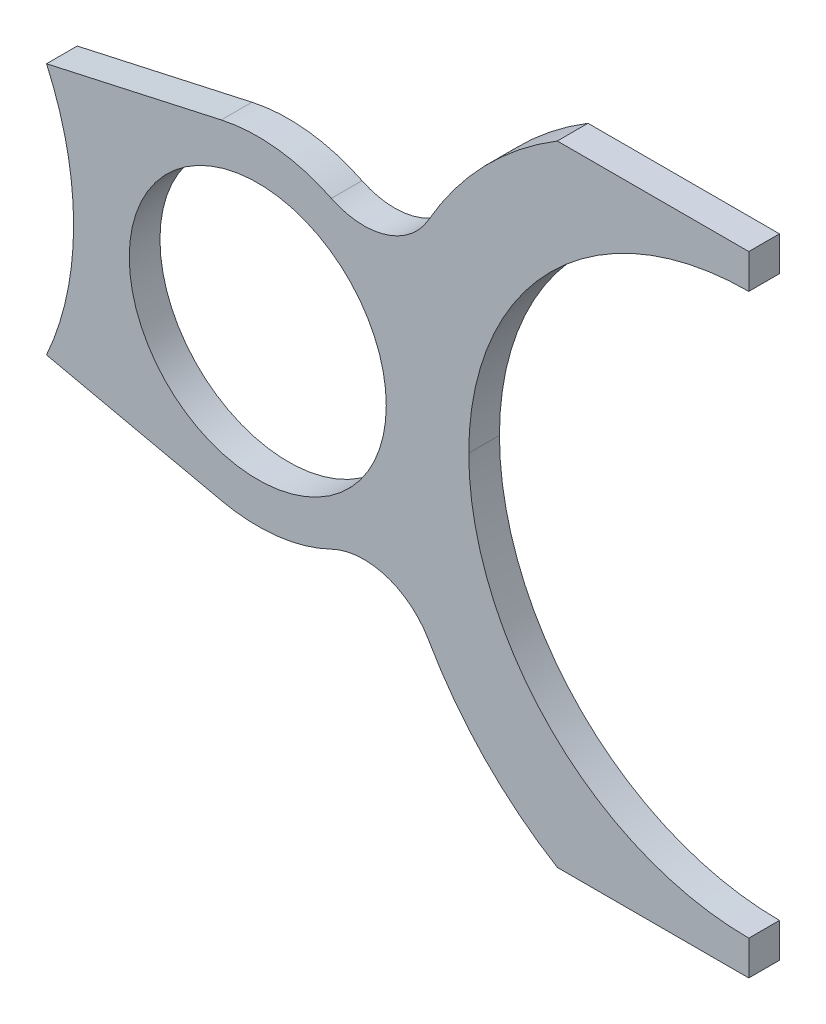
ISO-10303-21;
HEADER;
FILE_DESCRIPTION(('STEP AP214'),'2;1');
FILE_NAME('part.step','',(''),(''),'','','');
FILE_SCHEMA(('AUTOMOTIVE_DESIGN { 1 0 10303 214 1 1 1 1 }'));
ENDSEC;
DATA;
#1=APPLICATION_CONTEXT('core data for automotive mechanical design processes');
#2=APPLICATION_PROTOCOL_DEFINITION('international standard','automotive_design',2000,#1);
#3=PRODUCT_CONTEXT('',#1,'mechanical');
#4=PRODUCT('Part','Part','',(#3));
#5=PRODUCT_RELATED_PRODUCT_CATEGORY('part','',(#4));
#6=PRODUCT_DEFINITION_FORMATION('','',#4);
#7=PRODUCT_DEFINITION_CONTEXT('part definition',#1,'design');
#8=PRODUCT_DEFINITION('design','',#6,#7);
#9=PRODUCT_DEFINITION_SHAPE('','',#8);
#10=(LENGTH_UNIT() NAMED_UNIT(*) SI_UNIT(.MILLI.,.METRE.));
#11=(NAMED_UNIT(*) PLANE_ANGLE_UNIT() SI_UNIT($,.RADIAN.));
#12=(NAMED_UNIT(*) SI_UNIT($,.STERADIAN.) SOLID_ANGLE_UNIT());
#13=UNCERTAINTY_MEASURE_WITH_UNIT(LENGTH_MEASURE(1.E-05),#10,'distance_accuracy_value','');
#14=(GEOMETRIC_REPRESENTATION_CONTEXT(3) GLOBAL_UNCERTAINTY_ASSIGNED_CONTEXT((#13)) GLOBAL_UNIT_ASSIGNED_CONTEXT((#10,
#11,#12)) REPRESENTATION_CONTEXT('',''));
#15=CARTESIAN_POINT('',(0.,0.,0.));
#16=DIRECTION('',(0.,0.,1.));
#17=DIRECTION('',(1.,0.,0.));
#18=AXIS2_PLACEMENT_3D('',#15,#16,#17);
#19=CARTESIAN_POINT('',(74.4480072134487,-16.0000723388043,2.));
#20=DIRECTION('',(0.,0.,1.));
#21=DIRECTION('',(1.,0.,0.));
#22=AXIS2_PLACEMENT_3D('',#19,#20,#21);
#23=PLANE('',#22);
#24=CARTESIAN_POINT('',(74.4480072134487,-16.0000723388043,2.));
#25=DIRECTION('',(0.,0.,-1.));
#26=DIRECTION('',(1.,0.,0.));
#27=AXIS2_PLACEMENT_3D('',#24,#25,#26);
#28=CIRCLE('',#27,18.2499999997204);
#29=CARTESIAN_POINT('',(56.1980072137284,-16.0000706020517,2.));
#30=VERTEX_POINT('',#29);
#31=CARTESIAN_POINT('',(74.4480109338911,2.24992766091565,2.));
#32=VERTEX_POINT('',#31);
#33=EDGE_CURVE('E209',#30,#32,#28,.T.);
#34=ORIENTED_EDGE('',*,*,#33,.T.);
#35=DIRECTION('',(-2.68384574157079E-06,0.999999999996398,0.));
#36=VECTOR('',#35,1.);
#37=CARTESIAN_POINT('',(74.4480109338911,2.24992766091565,2.));
#38=LINE('',#37,#36);
#39=CARTESIAN_POINT('',(74.4480048948167,4.50008471778701,2.));
#40=VERTEX_POINT('',#39);
#41=EDGE_CURVE('E117',#32,#40,#38,.T.);
#42=ORIENTED_EDGE('',*,*,#41,.T.);
#43=DIRECTION('',(-0.999999999979796,-6.356641535331E-06,0.));
#44=VECTOR('',#43,1.);
#45=CARTESIAN_POINT('',(74.4480048948167,4.50008471778701,2.));
#46=LINE('',#45,#44);
#47=CARTESIAN_POINT('',(61.9681509162957,4.50000538782885,2.));
#48=VERTEX_POINT('',#47);
#49=EDGE_CURVE('E248',#40,#48,#46,.T.);
#50=ORIENTED_EDGE('',*,*,#49,.T.);
#51=CARTESIAN_POINT('',(74.4480072134487,-16.0000723388043,2.));
#52=DIRECTION('',(0.,0.,1.));
#53=DIRECTION('',(1.,0.,0.));
#54=AXIS2_PLACEMENT_3D('',#51,#52,#53);
#55=CIRCLE('',#54,24.0000000000073);
#56=CARTESIAN_POINT('',(53.5884918374886,-4.13075819347851,2.));
#57=VERTEX_POINT('',#56);
#58=EDGE_CURVE('E267',#48,#57,#55,.T.);
#59=ORIENTED_EDGE('',*,*,#58,.T.);
#60=CARTESIAN_POINT('',(49.3641728632781,-1.72707008982647,2.));
#61=DIRECTION('',(0.,0.,-1.));
#62=DIRECTION('',(1.,0.,0.));
#63=AXIS2_PLACEMENT_3D('',#60,#61,#62);
#64=CIRCLE('',#63,4.86030732511318);
#65=CARTESIAN_POINT('',(47.2447504661089,-6.10092834049331,2.));
#66=VERTEX_POINT('',#65);
#67=EDGE_CURVE('E264',#57,#66,#64,.T.);
#68=ORIENTED_EDGE('',*,*,#67,.T.);
#69=CARTESIAN_POINT('',(42.4480072131691,-15.9999815358943,2.));
#70=DIRECTION('',(0.,0.,1.));
#71=DIRECTION('',(1.,0.,0.));
#72=AXIS2_PLACEMENT_3D('',#69,#70,#71);
#73=CIRCLE('',#72,11.0000000000002);
#74=CARTESIAN_POINT('',(40.0693650208145,-5.26023939184106,2.));
#75=VERTEX_POINT('',#74);
#76=EDGE_CURVE('E266',#66,#75,#73,.T.);
#77=ORIENTED_EDGE('',*,*,#76,.T.);
#78=DIRECTION('',(-0.976340194913392,-0.216240199307343,0.));
#79=VECTOR('',#78,1.);
#80=CARTESIAN_POINT('',(40.0693650208145,-5.26023939184106,2.));
#81=LINE('',#80,#79);
#82=CARTESIAN_POINT('',(28.6821077627801,-7.78229347900254,2.));
#83=VERTEX_POINT('',#82);
#84=EDGE_CURVE('E269',#75,#83,#81,.T.);
#85=ORIENTED_EDGE('',*,*,#84,.T.);
#86=CARTESIAN_POINT('',(10.4482772196499,-15.9998006268187,2.));
#87=DIRECTION('',(0.,0.,-1.));
#88=DIRECTION('',(1.,0.,0.));
#89=AXIS2_PLACEMENT_3D('',#86,#87,#88);
#90=CIRCLE('',#89,20.);
#91=CARTESIAN_POINT('',(30.4482772186561,-16.0000000007485,2.));
#92=VERTEX_POINT('',#91);
#93=EDGE_CURVE('E275',#83,#92,#90,.T.);
#94=ORIENTED_EDGE('',*,*,#93,.T.);
#95=CARTESIAN_POINT('',(10.44827721965,-16.0001993746783,2.));
#96=DIRECTION('',(0.,0.,-1.));
#97=DIRECTION('',(1.,0.,0.));
#98=AXIS2_PLACEMENT_3D('',#95,#96,#97);
#99=CIRCLE('',#98,19.9999999999999);
#100=CARTESIAN_POINT('',(28.6821077627801,-24.2177065224945,2.));
#101=VERTEX_POINT('',#100);
#102=EDGE_CURVE('E277',#92,#101,#99,.T.);
#103=ORIENTED_EDGE('',*,*,#102,.T.);
#104=DIRECTION('',(0.97634019491392,-0.216240199304961,0.));
#105=VECTOR('',#104,1.);
#106=CARTESIAN_POINT('',(28.6821077627801,-24.2177065224945,2.));
#107=LINE('',#106,#105);
#108=CARTESIAN_POINT('',(40.0693650208207,-26.7397606096282,2.));
#109=VERTEX_POINT('',#108);
#110=EDGE_CURVE('E279',#101,#109,#107,.T.);
#111=ORIENTED_EDGE('',*,*,#110,.T.);
#112=CARTESIAN_POINT('',(42.4480072131691,-16.0000184656028,2.));
#113=DIRECTION('',(0.,0.,1.));
#114=DIRECTION('',(1.,0.,0.));
#115=AXIS2_PLACEMENT_3D('',#112,#113,#114);
#116=CIRCLE('',#115,10.9999999999716);
#117=CARTESIAN_POINT('',(47.2447504660965,-25.8990716609781,2.));
#118=VERTEX_POINT('',#117);
#119=EDGE_CURVE('E281',#109,#118,#116,.T.);
#120=ORIENTED_EDGE('',*,*,#119,.T.);
#121=CARTESIAN_POINT('',(49.3641728632567,-30.2729299116639,2.));
#122=DIRECTION('',(0.,0.,-1.));
#123=DIRECTION('',(1.,0.,0.));
#124=AXIS2_PLACEMENT_3D('',#121,#122,#123);
#125=CIRCLE('',#124,4.86030732512629);
#126=CARTESIAN_POINT('',(53.5884918374005,-27.8692418080686,2.));
#127=VERTEX_POINT('',#126);
#128=EDGE_CURVE('E283',#118,#127,#125,.T.);
#129=ORIENTED_EDGE('',*,*,#128,.T.);
#130=CARTESIAN_POINT('',(74.4480072131689,-15.9999276624131,2.));
#131=DIRECTION('',(0.,0.,1.));
#132=DIRECTION('',(1.,0.,0.));
#133=AXIS2_PLACEMENT_3D('',#130,#131,#132);
#134=CIRCLE('',#133,24.0000000000037);
#135=CARTESIAN_POINT('',(61.9681509162946,-36.5000053893278,2.));
#136=VERTEX_POINT('',#135);
#137=EDGE_CURVE('E160',#127,#136,#134,.T.);
#138=ORIENTED_EDGE('',*,*,#137,.T.);
#139=DIRECTION('',(0.999999999979797,-6.35664138479136E-06,0.));
#140=VECTOR('',#139,1.);
#141=CARTESIAN_POINT('',(61.9681509162946,-36.5000053893278,2.));
#142=LINE('',#141,#140);
#143=CARTESIAN_POINT('',(74.4480048948167,-36.5000847192841,2.));
#144=VERTEX_POINT('',#143);
#145=EDGE_CURVE('E154',#136,#144,#142,.T.);
#146=ORIENTED_EDGE('',*,*,#145,.T.);
#147=DIRECTION('',(2.68384574157115E-06,0.999999999996398,0.));
#148=VECTOR('',#147,1.);
#149=CARTESIAN_POINT('',(74.4480048948167,-36.5000847192841,2.));
#150=LINE('',#149,#148);
#151=CARTESIAN_POINT('',(74.4480109338911,-34.249927662413,2.));
#152=VERTEX_POINT('',#151);
#153=EDGE_CURVE('E158',#144,#152,#150,.T.);
#154=ORIENTED_EDGE('',*,*,#153,.T.);
#155=CARTESIAN_POINT('',(74.4480072131689,-15.9999276624131,2.));
#156=DIRECTION('',(0.,0.,-1.));
#157=DIRECTION('',(1.,0.,0.));
#158=AXIS2_PLACEMENT_3D('',#155,#156,#157);
#159=CIRCLE('',#158,18.2500000000003);
#160=EDGE_CURVE('E50',#152,#30,#159,.T.);
#161=ORIENTED_EDGE('',*,*,#160,.T.);
#162=EDGE_LOOP('',(#34,#42,#50,#59,#68,#77,#85,#94,#103,#111,#120,#129,#138,#146,#154,#161));
#163=FACE_BOUND('',#162,.T.);
#164=CARTESIAN_POINT('',(42.4480072131691,-15.9999815358943,2.));
#165=DIRECTION('',(0.,0.,1.));
#166=DIRECTION('',(1.,0.,0.));
#167=AXIS2_PLACEMENT_3D('',#164,#165,#166);
#168=CIRCLE('',#167,8.37500000000001);
#169=CARTESIAN_POINT('',(50.8230072131691,-15.9999815358943,2.));
#170=VERTEX_POINT('',#169);
#171=EDGE_CURVE('E182',#170,#170,#168,.T.);
#172=ORIENTED_EDGE('',*,*,#171,.F.);
#173=EDGE_LOOP('',(#172));
#174=FACE_BOUND('',#173,.T.);
#175=ADVANCED_FACE('F33',(#163,#174),#23,.T.);
#176=CARTESIAN_POINT('',(74.4480072134487,-16.0000723388043,0.));
#177=DIRECTION('',(0.,0.,1.));
#178=DIRECTION('',(1.,0.,0.));
#179=AXIS2_PLACEMENT_3D('',#176,#177,#178);
#180=PLANE('',#179);
#181=CARTESIAN_POINT('',(74.4480072134487,-16.0000723388043,0.));
#182=DIRECTION('',(0.,0.,-1.));
#183=DIRECTION('',(1.,0.,0.));
#184=AXIS2_PLACEMENT_3D('',#181,#182,#183);
#185=CIRCLE('',#184,18.2499999997204);
#186=CARTESIAN_POINT('',(56.1980072137284,-16.0000706020517,0.));
#187=VERTEX_POINT('',#186);
#188=CARTESIAN_POINT('',(74.4480109338911,2.24992766091565,0.));
#189=VERTEX_POINT('',#188);
#190=EDGE_CURVE('E178',#187,#189,#185,.T.);
#191=ORIENTED_EDGE('',*,*,#190,.F.);
#192=CARTESIAN_POINT('',(74.4480072131689,-15.9999276624131,0.));
#193=DIRECTION('',(0.,0.,-1.));
#194=DIRECTION('',(1.,0.,0.));
#195=AXIS2_PLACEMENT_3D('',#192,#193,#194);
#196=CIRCLE('',#195,18.2500000000003);
#197=CARTESIAN_POINT('',(74.4480109338911,-34.249927662413,0.));
#198=VERTEX_POINT('',#197);
#199=EDGE_CURVE('E109',#198,#187,#196,.T.);
#200=ORIENTED_EDGE('',*,*,#199,.F.);
#201=DIRECTION('',(2.68384574157115E-06,0.999999999996398,0.));
#202=VECTOR('',#201,1.);
#203=CARTESIAN_POINT('',(74.4480048948167,-36.5000847192841,0.));
#204=LINE('',#203,#202);
#205=CARTESIAN_POINT('',(74.4480048948167,-36.5000847192841,0.));
#206=VERTEX_POINT('',#205);
#207=EDGE_CURVE('E103',#206,#198,#204,.T.);
#208=ORIENTED_EDGE('',*,*,#207,.F.);
#209=DIRECTION('',(0.999999999979797,-6.35664138479136E-06,0.));
#210=VECTOR('',#209,1.);
#211=CARTESIAN_POINT('',(61.9681509162946,-36.5000053893278,0.));
#212=LINE('',#211,#210);
#213=CARTESIAN_POINT('',(61.9681509162946,-36.5000053893278,0.));
#214=VERTEX_POINT('',#213);
#215=EDGE_CURVE('E168',#214,#206,#212,.T.);
#216=ORIENTED_EDGE('',*,*,#215,.F.);
#217=CARTESIAN_POINT('',(74.4480072131689,-15.9999276624131,0.));
#218=DIRECTION('',(0.,0.,1.));
#219=DIRECTION('',(1.,0.,0.));
#220=AXIS2_PLACEMENT_3D('',#217,#218,#219);
#221=CIRCLE('',#220,24.0000000000037);
#222=CARTESIAN_POINT('',(53.5884918374005,-27.8692418080686,0.));
#223=VERTEX_POINT('',#222);
#224=EDGE_CURVE('E204',#223,#214,#221,.T.);
#225=ORIENTED_EDGE('',*,*,#224,.F.);
#226=CARTESIAN_POINT('',(49.3641728632567,-30.2729299116639,0.));
#227=DIRECTION('',(0.,0.,-1.));
#228=DIRECTION('',(1.,0.,0.));
#229=AXIS2_PLACEMENT_3D('',#226,#227,#228);
#230=CIRCLE('',#229,4.86030732512629);
#231=CARTESIAN_POINT('',(47.2447504660965,-25.8990716609781,0.));
#232=VERTEX_POINT('',#231);
#233=EDGE_CURVE('E202',#232,#223,#230,.T.);
#234=ORIENTED_EDGE('',*,*,#233,.F.);
#235=CARTESIAN_POINT('',(42.4480072131691,-16.0000184656028,0.));
#236=DIRECTION('',(0.,0.,1.));
#237=DIRECTION('',(1.,0.,0.));
#238=AXIS2_PLACEMENT_3D('',#235,#236,#237);
#239=CIRCLE('',#238,10.9999999999716);
#240=CARTESIAN_POINT('',(40.0693650208207,-26.7397606096282,0.));
#241=VERTEX_POINT('',#240);
#242=EDGE_CURVE('E200',#241,#232,#239,.T.);
#243=ORIENTED_EDGE('',*,*,#242,.F.);
#244=DIRECTION('',(0.97634019491392,-0.216240199304961,0.));
#245=VECTOR('',#244,1.);
#246=CARTESIAN_POINT('',(28.6821077627801,-24.2177065224945,0.));
#247=LINE('',#246,#245);
#248=CARTESIAN_POINT('',(28.6821077627801,-24.2177065224945,0.));
#249=VERTEX_POINT('',#248);
#250=EDGE_CURVE('E198',#249,#241,#247,.T.);
#251=ORIENTED_EDGE('',*,*,#250,.F.);
#252=CARTESIAN_POINT('',(10.44827721965,-16.0001993746783,0.));
#253=DIRECTION('',(0.,0.,-1.));
#254=DIRECTION('',(1.,0.,0.));
#255=AXIS2_PLACEMENT_3D('',#252,#253,#254);
#256=CIRCLE('',#255,19.9999999999999);
#257=CARTESIAN_POINT('',(30.4482772186561,-16.0000000007485,0.));
#258=VERTEX_POINT('',#257);
#259=EDGE_CURVE('E196',#258,#249,#256,.T.);
#260=ORIENTED_EDGE('',*,*,#259,.F.);
#261=CARTESIAN_POINT('',(10.4482772196499,-15.9998006268187,0.));
#262=DIRECTION('',(0.,0.,-1.));
#263=DIRECTION('',(1.,0.,0.));
#264=AXIS2_PLACEMENT_3D('',#261,#262,#263);
#265=CIRCLE('',#264,20.);
#266=CARTESIAN_POINT('',(28.6821077627801,-7.78229347900254,0.));
#267=VERTEX_POINT('',#266);
#268=EDGE_CURVE('E194',#267,#258,#265,.T.);
#269=ORIENTED_EDGE('',*,*,#268,.F.);
#270=DIRECTION('',(-0.976340194913392,-0.216240199307343,0.));
#271=VECTOR('',#270,1.);
#272=CARTESIAN_POINT('',(40.0693650208145,-5.26023939184106,0.));
#273=LINE('',#272,#271);
#274=CARTESIAN_POINT('',(40.0693650208145,-5.26023939184106,0.));
#275=VERTEX_POINT('',#274);
#276=EDGE_CURVE('E192',#275,#267,#273,.T.);
#277=ORIENTED_EDGE('',*,*,#276,.F.);
#278=CARTESIAN_POINT('',(42.4480072131691,-15.9999815358943,0.));
#279=DIRECTION('',(0.,0.,1.));
#280=DIRECTION('',(1.,0.,0.));
#281=AXIS2_PLACEMENT_3D('',#278,#279,#280);
#282=CIRCLE('',#281,11.0000000000002);
#283=CARTESIAN_POINT('',(47.2447504661089,-6.10092834049331,0.));
#284=VERTEX_POINT('',#283);
#285=EDGE_CURVE('E190',#284,#275,#282,.T.);
#286=ORIENTED_EDGE('',*,*,#285,.F.);
#287=CARTESIAN_POINT('',(49.3641728632781,-1.72707008982647,0.));
#288=DIRECTION('',(0.,0.,-1.));
#289=DIRECTION('',(1.,0.,0.));
#290=AXIS2_PLACEMENT_3D('',#287,#288,#289);
#291=CIRCLE('',#290,4.86030732511318);
#292=CARTESIAN_POINT('',(53.5884918374886,-4.13075819347851,0.));
#293=VERTEX_POINT('',#292);
#294=EDGE_CURVE('E188',#293,#284,#291,.T.);
#295=ORIENTED_EDGE('',*,*,#294,.F.);
#296=CARTESIAN_POINT('',(74.4480072134487,-16.0000723388043,0.));
#297=DIRECTION('',(0.,0.,1.));
#298=DIRECTION('',(1.,0.,0.));
#299=AXIS2_PLACEMENT_3D('',#296,#297,#298);
#300=CIRCLE('',#299,24.0000000000073);
#301=CARTESIAN_POINT('',(61.9681509162957,4.50000538782885,0.));
#302=VERTEX_POINT('',#301);
#303=EDGE_CURVE('E186',#302,#293,#300,.T.);
#304=ORIENTED_EDGE('',*,*,#303,.F.);
#305=DIRECTION('',(-0.999999999979796,-6.356641535331E-06,0.));
#306=VECTOR('',#305,1.);
#307=CARTESIAN_POINT('',(74.4480048948167,4.50008471778701,0.));
#308=LINE('',#307,#306);
#309=CARTESIAN_POINT('',(74.4480048948167,4.50008471778701,0.));
#310=VERTEX_POINT('',#309);
#311=EDGE_CURVE('E184',#310,#302,#308,.T.);
#312=ORIENTED_EDGE('',*,*,#311,.F.);
#313=DIRECTION('',(-2.68384574157079E-06,0.999999999996398,0.));
#314=VECTOR('',#313,1.);
#315=CARTESIAN_POINT('',(74.4480109338911,2.24992766091565,0.));
#316=LINE('',#315,#314);
#317=EDGE_CURVE('E181',#189,#310,#316,.T.);
#318=ORIENTED_EDGE('',*,*,#317,.F.);
#319=EDGE_LOOP('',(#191,#200,#208,#216,#225,#234,#243,#251,#260,#269,#277,#286,#295,#304,#312,#318));
#320=FACE_BOUND('',#319,.T.);
#321=CARTESIAN_POINT('',(42.4480072131691,-15.9999815358943,0.));
#322=DIRECTION('',(0.,0.,1.));
#323=DIRECTION('',(1.,0.,0.));
#324=AXIS2_PLACEMENT_3D('',#321,#322,#323);
#325=CIRCLE('',#324,8.37500000000001);
#326=CARTESIAN_POINT('',(50.8230072131691,-15.9999815358943,0.));
#327=VERTEX_POINT('',#326);
#328=EDGE_CURVE('E482',#327,#327,#325,.T.);
#329=ORIENTED_EDGE('',*,*,#328,.T.);
#330=EDGE_LOOP('',(#329));
#331=FACE_BOUND('',#330,.T.);
#332=ADVANCED_FACE('F252',(#320,#331),#180,.F.);
#333=CARTESIAN_POINT('',(74.4480072134487,-16.0000723388043,2.));
#334=DIRECTION('',(0.,0.,-1.));
#335=DIRECTION('',(-1.,0.,0.));
#336=AXIS2_PLACEMENT_3D('',#333,#334,#335);
#337=CYLINDRICAL_SURFACE('',#336,18.2499999997204);
#338=ORIENTED_EDGE('',*,*,#190,.T.);
#339=DIRECTION('',(0.,0.,-1.));
#340=VECTOR('',#339,1.);
#341=CARTESIAN_POINT('',(74.4480109338911,2.24992766091565,2.));
#342=LINE('',#341,#340);
#343=EDGE_CURVE('E11',#32,#189,#342,.T.);
#344=ORIENTED_EDGE('',*,*,#343,.F.);
#345=ORIENTED_EDGE('',*,*,#33,.F.);
#346=DIRECTION('',(0.,0.,-1.));
#347=VECTOR('',#346,1.);
#348=CARTESIAN_POINT('',(56.1980072137284,-16.0000706020517,2.));
#349=LINE('',#348,#347);
#350=EDGE_CURVE('E174',#30,#187,#349,.T.);
#351=ORIENTED_EDGE('',*,*,#350,.T.);
#352=EDGE_LOOP('',(#338,#344,#345,#351));
#353=FACE_BOUND('',#352,.T.);
#354=ADVANCED_FACE('F35',(#353),#337,.F.);
#355=CARTESIAN_POINT('',(74.4480109338911,2.24992766091565,2.));
#356=DIRECTION('',(-0.999999999996399,-2.68384574157079E-06,0.));
#357=DIRECTION('',(2.68384574157079E-06,-0.999999999996399,0.));
#358=AXIS2_PLACEMENT_3D('',#355,#356,#357);
#359=PLANE('',#358);
#360=ORIENTED_EDGE('',*,*,#317,.T.);
#361=DIRECTION('',(0.,0.,-1.));
#362=VECTOR('',#361,1.);
#363=CARTESIAN_POINT('',(74.4480048948167,4.50008471778701,2.));
#364=LINE('',#363,#362);
#365=EDGE_CURVE('E42',#40,#310,#364,.T.);
#366=ORIENTED_EDGE('',*,*,#365,.F.);
#367=ORIENTED_EDGE('',*,*,#41,.F.);
#368=ORIENTED_EDGE('',*,*,#343,.T.);
#369=EDGE_LOOP('',(#360,#366,#367,#368));
#370=FACE_BOUND('',#369,.T.);
#371=ADVANCED_FACE('F317',(#370),#359,.F.);
#372=CARTESIAN_POINT('',(74.4480048948167,4.50008471778701,2.));
#373=DIRECTION('',(6.356641535331E-06,-0.999999999979797,0.));
#374=DIRECTION('',(0.999999999979797,6.356641535331E-06,0.));
#375=AXIS2_PLACEMENT_3D('',#372,#373,#374);
#376=PLANE('',#375);
#377=ORIENTED_EDGE('',*,*,#311,.T.);
#378=DIRECTION('',(0.,0.,-1.));
#379=VECTOR('',#378,1.);
#380=CARTESIAN_POINT('',(61.9681509162957,4.50000538782885,2.));
#381=LINE('',#380,#379);
#382=EDGE_CURVE('E240',#48,#302,#381,.T.);
#383=ORIENTED_EDGE('',*,*,#382,.F.);
#384=ORIENTED_EDGE('',*,*,#49,.F.);
#385=ORIENTED_EDGE('',*,*,#365,.T.);
#386=EDGE_LOOP('',(#377,#383,#384,#385));
#387=FACE_BOUND('',#386,.T.);
#388=ADVANCED_FACE('F246',(#387),#376,.F.);
#389=CARTESIAN_POINT('',(74.4480072134487,-16.0000723388043,2.));
#390=DIRECTION('',(0.,0.,-1.));
#391=DIRECTION('',(-1.,0.,0.));
#392=AXIS2_PLACEMENT_3D('',#389,#390,#391);
#393=CYLINDRICAL_SURFACE('',#392,24.0000000000073);
#394=ORIENTED_EDGE('',*,*,#303,.T.);
#395=DIRECTION('',(0.,0.,-1.));
#396=VECTOR('',#395,1.);
#397=CARTESIAN_POINT('',(53.5884918374886,-4.13075819347851,2.));
#398=LINE('',#397,#396);
#399=EDGE_CURVE('E237',#57,#293,#398,.T.);
#400=ORIENTED_EDGE('',*,*,#399,.F.);
#401=ORIENTED_EDGE('',*,*,#58,.F.);
#402=ORIENTED_EDGE('',*,*,#382,.T.);
#403=EDGE_LOOP('',(#394,#400,#401,#402));
#404=FACE_BOUND('',#403,.T.);
#405=ADVANCED_FACE('F258',(#404),#393,.T.);
#406=CARTESIAN_POINT('',(49.3641728632781,-1.72707008982647,2.));
#407=DIRECTION('',(0.,0.,-1.));
#408=DIRECTION('',(-1.,0.,0.));
#409=AXIS2_PLACEMENT_3D('',#406,#407,#408);
#410=CYLINDRICAL_SURFACE('',#409,4.86030732511318);
#411=ORIENTED_EDGE('',*,*,#294,.T.);
#412=DIRECTION('',(0.,0.,-1.));
#413=VECTOR('',#412,1.);
#414=CARTESIAN_POINT('',(47.2447504661089,-6.10092834049331,2.));
#415=LINE('',#414,#413);
#416=EDGE_CURVE('E234',#66,#284,#415,.T.);
#417=ORIENTED_EDGE('',*,*,#416,.F.);
#418=ORIENTED_EDGE('',*,*,#67,.F.);
#419=ORIENTED_EDGE('',*,*,#399,.T.);
#420=EDGE_LOOP('',(#411,#417,#418,#419));
#421=FACE_BOUND('',#420,.T.);
#422=ADVANCED_FACE('F262',(#421),#410,.F.);
#423=CARTESIAN_POINT('',(42.4480072131691,-15.9999815358943,2.));
#424=DIRECTION('',(0.,0.,-1.));
#425=DIRECTION('',(-1.,0.,0.));
#426=AXIS2_PLACEMENT_3D('',#423,#424,#425);
#427=CYLINDRICAL_SURFACE('',#426,11.0000000000002);
#428=ORIENTED_EDGE('',*,*,#285,.T.);
#429=DIRECTION('',(0.,0.,-1.));
#430=VECTOR('',#429,1.);
#431=CARTESIAN_POINT('',(40.0693650208145,-5.26023939184106,2.));
#432=LINE('',#431,#430);
#433=EDGE_CURVE('E231',#75,#275,#432,.T.);
#434=ORIENTED_EDGE('',*,*,#433,.F.);
#435=ORIENTED_EDGE('',*,*,#76,.F.);
#436=ORIENTED_EDGE('',*,*,#416,.T.);
#437=EDGE_LOOP('',(#428,#434,#435,#436));
#438=FACE_BOUND('',#437,.T.);
#439=ADVANCED_FACE('F330',(#438),#427,.T.);
#440=CARTESIAN_POINT('',(40.0693650208145,-5.26023939184106,2.));
#441=DIRECTION('',(0.216240199307343,-0.976340194913392,0.));
#442=DIRECTION('',(0.976340194913392,0.216240199307344,0.));
#443=AXIS2_PLACEMENT_3D('',#440,#441,#442);
#444=PLANE('',#443);
#445=ORIENTED_EDGE('',*,*,#276,.T.);
#446=DIRECTION('',(0.,0.,-1.));
#447=VECTOR('',#446,1.);
#448=CARTESIAN_POINT('',(28.6821077627801,-7.78229347900254,2.));
#449=LINE('',#448,#447);
#450=EDGE_CURVE('E228',#83,#267,#449,.T.);
#451=ORIENTED_EDGE('',*,*,#450,.F.);
#452=ORIENTED_EDGE('',*,*,#84,.F.);
#453=ORIENTED_EDGE('',*,*,#433,.T.);
#454=EDGE_LOOP('',(#445,#451,#452,#453));
#455=FACE_BOUND('',#454,.T.);
#456=ADVANCED_FACE('F333',(#455),#444,.F.);
#457=CARTESIAN_POINT('',(10.4482772196499,-15.9998006268187,2.));
#458=DIRECTION('',(0.,0.,-1.));
#459=DIRECTION('',(-1.,0.,0.));
#460=AXIS2_PLACEMENT_3D('',#457,#458,#459);
#461=CYLINDRICAL_SURFACE('',#460,20.);
#462=ORIENTED_EDGE('',*,*,#268,.T.);
#463=DIRECTION('',(0.,0.,-1.));
#464=VECTOR('',#463,1.);
#465=CARTESIAN_POINT('',(30.4482772186561,-16.0000000007485,2.));
#466=LINE('',#465,#464);
#467=EDGE_CURVE('E225',#92,#258,#466,.T.);
#468=ORIENTED_EDGE('',*,*,#467,.F.);
#469=ORIENTED_EDGE('',*,*,#93,.F.);
#470=ORIENTED_EDGE('',*,*,#450,.T.);
#471=EDGE_LOOP('',(#462,#468,#469,#470));
#472=FACE_BOUND('',#471,.T.);
#473=ADVANCED_FACE('F337',(#472),#461,.F.);
#474=CARTESIAN_POINT('',(10.44827721965,-16.0001993746783,2.));
#475=DIRECTION('',(0.,0.,-1.));
#476=DIRECTION('',(-1.,0.,0.));
#477=AXIS2_PLACEMENT_3D('',#474,#475,#476);
#478=CYLINDRICAL_SURFACE('',#477,19.9999999999999);
#479=ORIENTED_EDGE('',*,*,#259,.T.);
#480=DIRECTION('',(0.,0.,-1.));
#481=VECTOR('',#480,1.);
#482=CARTESIAN_POINT('',(28.6821077627801,-24.2177065224945,2.));
#483=LINE('',#482,#481);
#484=EDGE_CURVE('E222',#101,#249,#483,.T.);
#485=ORIENTED_EDGE('',*,*,#484,.F.);
#486=ORIENTED_EDGE('',*,*,#102,.F.);
#487=ORIENTED_EDGE('',*,*,#467,.T.);
#488=EDGE_LOOP('',(#479,#485,#486,#487));
#489=FACE_BOUND('',#488,.T.);
#490=ADVANCED_FACE('F341',(#489),#478,.F.);
#491=CARTESIAN_POINT('',(28.6821077627801,-24.2177065224945,2.));
#492=DIRECTION('',(0.216240199304961,0.97634019491392,0.));
#493=DIRECTION('',(-0.97634019491392,0.216240199304961,0.));
#494=AXIS2_PLACEMENT_3D('',#491,#492,#493);
#495=PLANE('',#494);
#496=ORIENTED_EDGE('',*,*,#250,.T.);
#497=DIRECTION('',(0.,0.,-1.));
#498=VECTOR('',#497,1.);
#499=CARTESIAN_POINT('',(40.0693650208207,-26.7397606096282,2.));
#500=LINE('',#499,#498);
#501=EDGE_CURVE('E219',#109,#241,#500,.T.);
#502=ORIENTED_EDGE('',*,*,#501,.F.);
#503=ORIENTED_EDGE('',*,*,#110,.F.);
#504=ORIENTED_EDGE('',*,*,#484,.T.);
#505=EDGE_LOOP('',(#496,#502,#503,#504));
#506=FACE_BOUND('',#505,.T.);
#507=ADVANCED_FACE('F345',(#506),#495,.F.);
#508=CARTESIAN_POINT('',(42.4480072131691,-16.0000184656028,2.));
#509=DIRECTION('',(0.,0.,-1.));
#510=DIRECTION('',(-1.,0.,0.));
#511=AXIS2_PLACEMENT_3D('',#508,#509,#510);
#512=CYLINDRICAL_SURFACE('',#511,10.9999999999716);
#513=ORIENTED_EDGE('',*,*,#242,.T.);
#514=DIRECTION('',(0.,0.,-1.));
#515=VECTOR('',#514,1.);
#516=CARTESIAN_POINT('',(47.2447504660965,-25.8990716609781,2.));
#517=LINE('',#516,#515);
#518=EDGE_CURVE('E216',#118,#232,#517,.T.);
#519=ORIENTED_EDGE('',*,*,#518,.F.);
#520=ORIENTED_EDGE('',*,*,#119,.F.);
#521=ORIENTED_EDGE('',*,*,#501,.T.);
#522=EDGE_LOOP('',(#513,#519,#520,#521));
#523=FACE_BOUND('',#522,.T.);
#524=ADVANCED_FACE('F349',(#523),#512,.T.);
#525=CARTESIAN_POINT('',(49.3641728632567,-30.2729299116639,2.));
#526=DIRECTION('',(0.,0.,-1.));
#527=DIRECTION('',(-1.,0.,0.));
#528=AXIS2_PLACEMENT_3D('',#525,#526,#527);
#529=CYLINDRICAL_SURFACE('',#528,4.86030732512629);
#530=ORIENTED_EDGE('',*,*,#233,.T.);
#531=DIRECTION('',(0.,0.,-1.));
#532=VECTOR('',#531,1.);
#533=CARTESIAN_POINT('',(53.5884918374005,-27.8692418080686,2.));
#534=LINE('',#533,#532);
#535=EDGE_CURVE('E213',#127,#223,#534,.T.);
#536=ORIENTED_EDGE('',*,*,#535,.F.);
#537=ORIENTED_EDGE('',*,*,#128,.F.);
#538=ORIENTED_EDGE('',*,*,#518,.T.);
#539=EDGE_LOOP('',(#530,#536,#537,#538));
#540=FACE_BOUND('',#539,.T.);
#541=ADVANCED_FACE('F289',(#540),#529,.F.);
#542=CARTESIAN_POINT('',(74.4480072131689,-15.9999276624131,2.));
#543=DIRECTION('',(0.,0.,-1.));
#544=DIRECTION('',(-1.,0.,0.));
#545=AXIS2_PLACEMENT_3D('',#542,#543,#544);
#546=CYLINDRICAL_SURFACE('',#545,24.0000000000037);
#547=ORIENTED_EDGE('',*,*,#224,.T.);
#548=DIRECTION('',(0.,0.,-1.));
#549=VECTOR('',#548,1.);
#550=CARTESIAN_POINT('',(61.9681509162946,-36.5000053893278,2.));
#551=LINE('',#550,#549);
#552=EDGE_CURVE('E169',#136,#214,#551,.T.);
#553=ORIENTED_EDGE('',*,*,#552,.F.);
#554=ORIENTED_EDGE('',*,*,#137,.F.);
#555=ORIENTED_EDGE('',*,*,#535,.T.);
#556=EDGE_LOOP('',(#547,#553,#554,#555));
#557=FACE_BOUND('',#556,.T.);
#558=ADVANCED_FACE('F293',(#557),#546,.T.);
#559=CARTESIAN_POINT('',(61.9681509162946,-36.5000053893278,2.));
#560=DIRECTION('',(6.35664138479136E-06,0.999999999979797,0.));
#561=DIRECTION('',(-0.999999999979797,6.35664138479136E-06,0.));
#562=AXIS2_PLACEMENT_3D('',#559,#560,#561);
#563=PLANE('',#562);
#564=ORIENTED_EDGE('',*,*,#215,.T.);
#565=DIRECTION('',(0.,0.,-1.));
#566=VECTOR('',#565,1.);
#567=CARTESIAN_POINT('',(74.4480048948167,-36.5000847192841,2.));
#568=LINE('',#567,#566);
#569=EDGE_CURVE('E165',#144,#206,#568,.T.);
#570=ORIENTED_EDGE('',*,*,#569,.F.);
#571=ORIENTED_EDGE('',*,*,#145,.F.);
#572=ORIENTED_EDGE('',*,*,#552,.T.);
#573=EDGE_LOOP('',(#564,#570,#571,#572));
#574=FACE_BOUND('',#573,.T.);
#575=ADVANCED_FACE('F166',(#574),#563,.F.);
#576=CARTESIAN_POINT('',(74.4480048948167,-36.5000847192841,2.));
#577=DIRECTION('',(-0.999999999996399,2.68384574157116E-06,0.));
#578=DIRECTION('',(-2.68384574157116E-06,-0.999999999996399,0.));
#579=AXIS2_PLACEMENT_3D('',#576,#577,#578);
#580=PLANE('',#579);
#581=ORIENTED_EDGE('',*,*,#207,.T.);
#582=DIRECTION('',(0.,0.,-1.));
#583=VECTOR('',#582,1.);
#584=CARTESIAN_POINT('',(74.4480109338911,-34.249927662413,2.));
#585=LINE('',#584,#583);
#586=EDGE_CURVE('E170',#152,#198,#585,.T.);
#587=ORIENTED_EDGE('',*,*,#586,.F.);
#588=ORIENTED_EDGE('',*,*,#153,.F.);
#589=ORIENTED_EDGE('',*,*,#569,.T.);
#590=EDGE_LOOP('',(#581,#587,#588,#589));
#591=FACE_BOUND('',#590,.T.);
#592=ADVANCED_FACE('F172',(#591),#580,.F.);
#593=CARTESIAN_POINT('',(74.4480072131689,-15.9999276624131,2.));
#594=DIRECTION('',(0.,0.,-1.));
#595=DIRECTION('',(-1.,0.,0.));
#596=AXIS2_PLACEMENT_3D('',#593,#594,#595);
#597=CYLINDRICAL_SURFACE('',#596,18.2500000000003);
#598=ORIENTED_EDGE('',*,*,#199,.T.);
#599=ORIENTED_EDGE('',*,*,#350,.F.);
#600=ORIENTED_EDGE('',*,*,#160,.F.);
#601=ORIENTED_EDGE('',*,*,#586,.T.);
#602=EDGE_LOOP('',(#598,#599,#600,#601));
#603=FACE_BOUND('',#602,.T.);
#604=ADVANCED_FACE('F297',(#603),#597,.F.);
#605=CARTESIAN_POINT('',(42.4480072131691,-15.9999815358943,2.));
#606=DIRECTION('',(0.,0.,-1.));
#607=DIRECTION('',(-1.,0.,0.));
#608=AXIS2_PLACEMENT_3D('',#605,#606,#607);
#609=CYLINDRICAL_SURFACE('',#608,8.37500000000001);
#610=ORIENTED_EDGE('',*,*,#171,.T.);
#611=EDGE_LOOP('',(#610));
#612=FACE_BOUND('',#611,.T.);
#613=ORIENTED_EDGE('',*,*,#328,.F.);
#614=EDGE_LOOP('',(#613));
#615=FACE_BOUND('',#614,.T.);
#616=ADVANCED_FACE('F299',(#612,#615),#609,.F.);
#617=CLOSED_SHELL('',(#175,#332,#354,#371,#388,#405,#422,#439,#456,#473,#490,#507,#524,#541,
#558,#575,#592,#604,#616));
#618=MANIFOLD_SOLID_BREP('B2',#617);
#619=ADVANCED_BREP_SHAPE_REPRESENTATION('',(#18,#618),#14);
#620=SHAPE_DEFINITION_REPRESENTATION(#9,#619);
ENDSEC;
END-ISO-10303-21;
